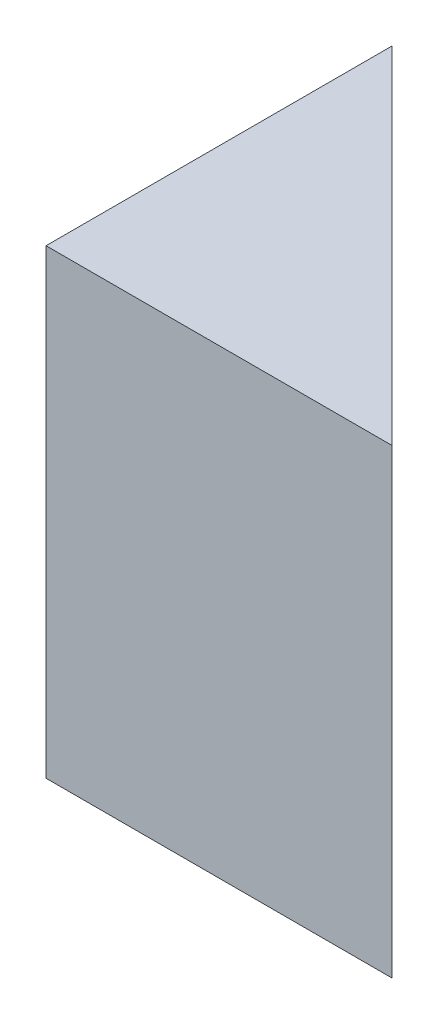
ISO-10303-21;
HEADER;
FILE_DESCRIPTION(('STEP AP214'),'2;1');
FILE_NAME('part.step','',(''),(''),'','','');
FILE_SCHEMA(('AUTOMOTIVE_DESIGN { 1 0 10303 214 1 1 1 1 }'));
ENDSEC;
DATA;
#1=APPLICATION_CONTEXT('core data for automotive mechanical design processes');
#2=APPLICATION_PROTOCOL_DEFINITION('international standard','automotive_design',2000,#1);
#3=PRODUCT_CONTEXT('',#1,'mechanical');
#4=PRODUCT('Part','Part','',(#3));
#5=PRODUCT_RELATED_PRODUCT_CATEGORY('part','',(#4));
#6=PRODUCT_DEFINITION_FORMATION('','',#4);
#7=PRODUCT_DEFINITION_CONTEXT('part definition',#1,'design');
#8=PRODUCT_DEFINITION('design','',#6,#7);
#9=PRODUCT_DEFINITION_SHAPE('','',#8);
#10=(LENGTH_UNIT() NAMED_UNIT(*) SI_UNIT(.MILLI.,.METRE.));
#11=(NAMED_UNIT(*) PLANE_ANGLE_UNIT() SI_UNIT($,.RADIAN.));
#12=(NAMED_UNIT(*) SI_UNIT($,.STERADIAN.) SOLID_ANGLE_UNIT());
#13=UNCERTAINTY_MEASURE_WITH_UNIT(LENGTH_MEASURE(1.E-05),#10,'distance_accuracy_value','');
#14=(GEOMETRIC_REPRESENTATION_CONTEXT(3) GLOBAL_UNCERTAINTY_ASSIGNED_CONTEXT((#13)) GLOBAL_UNIT_ASSIGNED_CONTEXT((#10,
#11,#12)) REPRESENTATION_CONTEXT('',''));
#15=CARTESIAN_POINT('',(0.,0.,0.));
#16=DIRECTION('',(0.,0.,1.));
#17=DIRECTION('',(1.,0.,0.));
#18=AXIS2_PLACEMENT_3D('',#15,#16,#17);
#19=CARTESIAN_POINT('',(19.05,25.4,0.));
#20=DIRECTION('',(-0.707106781186548,0.,0.707106781186548));
#21=DIRECTION('',(0.707106781186548,0.,0.707106781186548));
#22=AXIS2_PLACEMENT_3D('',#19,#20,#21);
#23=PLANE('',#22);
#24=DIRECTION('',(-0.707106781186547,0.,-0.707106781186547));
#25=VECTOR('',#24,1.);
#26=CARTESIAN_POINT('',(19.05,0.,0.));
#27=LINE('',#26,#25);
#28=CARTESIAN_POINT('',(19.05,0.,0.));
#29=VERTEX_POINT('',#28);
#30=CARTESIAN_POINT('',(0.,0.,-19.05));
#31=VERTEX_POINT('',#30);
#32=EDGE_CURVE('E79',#29,#31,#27,.T.);
#33=ORIENTED_EDGE('',*,*,#32,.T.);
#34=DIRECTION('',(0.,-1.,0.));
#35=VECTOR('',#34,1.);
#36=CARTESIAN_POINT('',(0.,25.4,-19.05));
#37=LINE('',#36,#35);
#38=CARTESIAN_POINT('',(0.,25.4,-19.05));
#39=VERTEX_POINT('',#38);
#40=EDGE_CURVE('E11',#39,#31,#37,.T.);
#41=ORIENTED_EDGE('',*,*,#40,.F.);
#42=DIRECTION('',(-0.707106781186547,0.,-0.707106781186547));
#43=VECTOR('',#42,1.);
#44=CARTESIAN_POINT('',(19.05,25.4,0.));
#45=LINE('',#44,#43);
#46=CARTESIAN_POINT('',(19.05,25.4,0.));
#47=VERTEX_POINT('',#46);
#48=EDGE_CURVE('E72',#47,#39,#45,.T.);
#49=ORIENTED_EDGE('',*,*,#48,.F.);
#50=DIRECTION('',(0.,-1.,0.));
#51=VECTOR('',#50,1.);
#52=CARTESIAN_POINT('',(19.05,25.4,0.));
#53=LINE('',#52,#51);
#54=EDGE_CURVE('E80',#47,#29,#53,.T.);
#55=ORIENTED_EDGE('',*,*,#54,.T.);
#56=EDGE_LOOP('',(#33,#41,#49,#55));
#57=FACE_BOUND('',#56,.T.);
#58=ADVANCED_FACE('F32',(#57),#23,.F.);
#59=CARTESIAN_POINT('',(0.,25.4,-19.05));
#60=DIRECTION('',(1.,0.,0.));
#61=DIRECTION('',(0.,0.,-1.));
#62=AXIS2_PLACEMENT_3D('',#59,#60,#61);
#63=PLANE('',#62);
#64=DIRECTION('',(0.,0.,1.));
#65=VECTOR('',#64,1.);
#66=CARTESIAN_POINT('',(0.,0.,-19.05));
#67=LINE('',#66,#65);
#68=CARTESIAN_POINT('',(0.,0.,0.));
#69=VERTEX_POINT('',#68);
#70=EDGE_CURVE('E60',#31,#69,#67,.T.);
#71=ORIENTED_EDGE('',*,*,#70,.T.);
#72=DIRECTION('',(0.,-1.,0.));
#73=VECTOR('',#72,1.);
#74=CARTESIAN_POINT('',(0.,25.4,0.));
#75=LINE('',#74,#73);
#76=CARTESIAN_POINT('',(0.,25.4,0.));
#77=VERTEX_POINT('',#76);
#78=EDGE_CURVE('E40',#77,#69,#75,.T.);
#79=ORIENTED_EDGE('',*,*,#78,.F.);
#80=DIRECTION('',(0.,0.,1.));
#81=VECTOR('',#80,1.);
#82=CARTESIAN_POINT('',(0.,25.4,-19.05));
#83=LINE('',#82,#81);
#84=EDGE_CURVE('E68',#39,#77,#83,.T.);
#85=ORIENTED_EDGE('',*,*,#84,.F.);
#86=ORIENTED_EDGE('',*,*,#40,.T.);
#87=EDGE_LOOP('',(#71,#79,#85,#86));
#88=FACE_BOUND('',#87,.T.);
#89=ADVANCED_FACE('F69',(#88),#63,.F.);
#90=CARTESIAN_POINT('',(0.,25.4,0.));
#91=DIRECTION('',(0.,0.,-1.));
#92=DIRECTION('',(-1.,0.,0.));
#93=AXIS2_PLACEMENT_3D('',#90,#91,#92);
#94=PLANE('',#93);
#95=DIRECTION('',(1.,0.,0.));
#96=VECTOR('',#95,1.);
#97=CARTESIAN_POINT('',(0.,0.,0.));
#98=LINE('',#97,#96);
#99=EDGE_CURVE('E65',#69,#29,#98,.T.);
#100=ORIENTED_EDGE('',*,*,#99,.T.);
#101=ORIENTED_EDGE('',*,*,#54,.F.);
#102=DIRECTION('',(1.,0.,0.));
#103=VECTOR('',#102,1.);
#104=CARTESIAN_POINT('',(0.,25.4,0.));
#105=LINE('',#104,#103);
#106=EDGE_CURVE('E48',#77,#47,#105,.T.);
#107=ORIENTED_EDGE('',*,*,#106,.F.);
#108=ORIENTED_EDGE('',*,*,#78,.T.);
#109=EDGE_LOOP('',(#100,#101,#107,#108));
#110=FACE_BOUND('',#109,.T.);
#111=ADVANCED_FACE('F87',(#110),#94,.F.);
#112=CARTESIAN_POINT('',(0.,25.4,0.));
#113=DIRECTION('',(0.,1.,0.));
#114=DIRECTION('',(0.,0.,1.));
#115=AXIS2_PLACEMENT_3D('',#112,#113,#114);
#116=PLANE('',#115);
#117=ORIENTED_EDGE('',*,*,#48,.T.);
#118=ORIENTED_EDGE('',*,*,#84,.T.);
#119=ORIENTED_EDGE('',*,*,#106,.T.);
#120=EDGE_LOOP('',(#117,#118,#119));
#121=FACE_BOUND('',#120,.T.);
#122=ADVANCED_FACE('F75',(#121),#116,.T.);
#123=CARTESIAN_POINT('',(0.,0.,0.));
#124=DIRECTION('',(0.,1.,0.));
#125=DIRECTION('',(0.,0.,1.));
#126=AXIS2_PLACEMENT_3D('',#123,#124,#125);
#127=PLANE('',#126);
#128=ORIENTED_EDGE('',*,*,#32,.F.);
#129=ORIENTED_EDGE('',*,*,#99,.F.);
#130=ORIENTED_EDGE('',*,*,#70,.F.);
#131=EDGE_LOOP('',(#128,#129,#130));
#132=FACE_BOUND('',#131,.T.);
#133=ADVANCED_FACE('F88',(#132),#127,.F.);
#134=CLOSED_SHELL('',(#58,#89,#111,#122,#133));
#135=MANIFOLD_SOLID_BREP('B2',#134);
#136=ADVANCED_BREP_SHAPE_REPRESENTATION('',(#18,#135),#14);
#137=SHAPE_DEFINITION_REPRESENTATION(#9,#136);
ENDSEC;
END-ISO-10303-21;
